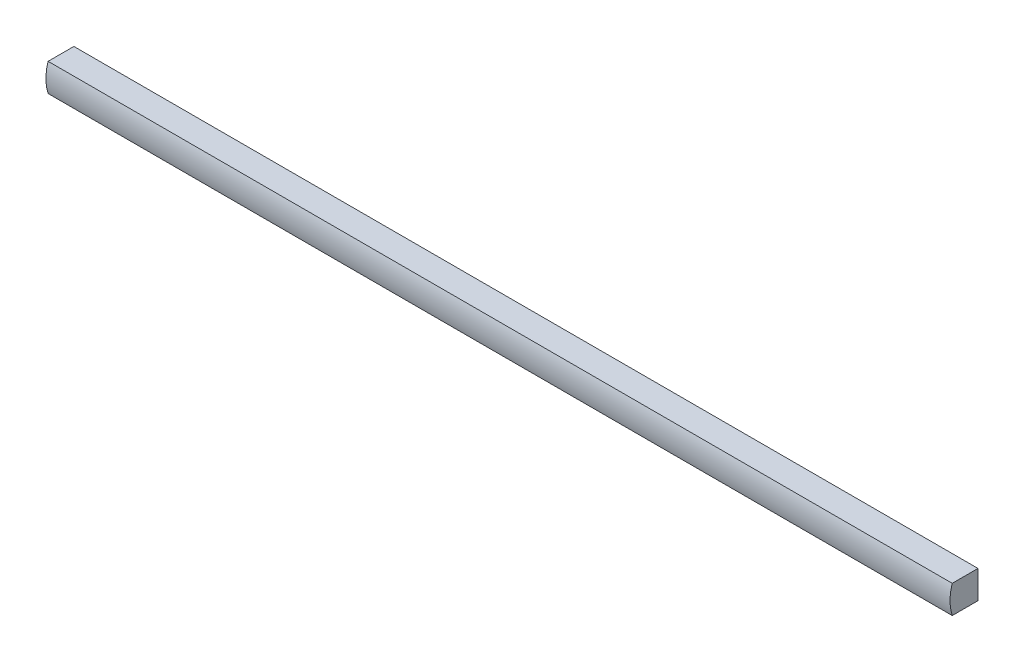
ISO-10303-21;
HEADER;
FILE_DESCRIPTION(('STEP AP214'),'2;1');
FILE_NAME('part.step','',(''),(''),'','','');
FILE_SCHEMA(('AUTOMOTIVE_DESIGN { 1 0 10303 214 1 1 1 1 }'));
ENDSEC;
DATA;
#1=APPLICATION_CONTEXT('core data for automotive mechanical design processes');
#2=APPLICATION_PROTOCOL_DEFINITION('international standard','automotive_design',2000,#1);
#3=PRODUCT_CONTEXT('',#1,'mechanical');
#4=PRODUCT('Part','Part','',(#3));
#5=PRODUCT_RELATED_PRODUCT_CATEGORY('part','',(#4));
#6=PRODUCT_DEFINITION_FORMATION('','',#4);
#7=PRODUCT_DEFINITION_CONTEXT('part definition',#1,'design');
#8=PRODUCT_DEFINITION('design','',#6,#7);
#9=PRODUCT_DEFINITION_SHAPE('','',#8);
#10=(LENGTH_UNIT() NAMED_UNIT(*) SI_UNIT(.MILLI.,.METRE.));
#11=(NAMED_UNIT(*) PLANE_ANGLE_UNIT() SI_UNIT($,.RADIAN.));
#12=(NAMED_UNIT(*) SI_UNIT($,.STERADIAN.) SOLID_ANGLE_UNIT());
#13=UNCERTAINTY_MEASURE_WITH_UNIT(LENGTH_MEASURE(1.E-05),#10,'distance_accuracy_value','');
#14=(GEOMETRIC_REPRESENTATION_CONTEXT(3) GLOBAL_UNCERTAINTY_ASSIGNED_CONTEXT((#13)) GLOBAL_UNIT_ASSIGNED_CONTEXT((#10,
#11,#12)) REPRESENTATION_CONTEXT('',''));
#15=CARTESIAN_POINT('',(0.,0.,0.));
#16=DIRECTION('',(0.,0.,1.));
#17=DIRECTION('',(1.,0.,0.));
#18=AXIS2_PLACEMENT_3D('',#15,#16,#17);
#19=CARTESIAN_POINT('',(-307.975,4.78267749181438,-15.5137071280691));
#20=DIRECTION('',(1.,0.,0.));
#21=DIRECTION('',(0.,0.,-1.));
#22=AXIS2_PLACEMENT_3D('',#19,#20,#21);
#23=CYLINDRICAL_SURFACE('',#22,15.5137071280691);
#24=CARTESIAN_POINT('',(0.,4.78267749181438,-15.5137071280691));
#25=DIRECTION('',(1.,0.,0.));
#26=DIRECTION('',(0.,0.,-1.));
#27=AXIS2_PLACEMENT_3D('',#24,#25,#26);
#28=CIRCLE('',#27,15.5137071280691);
#29=CARTESIAN_POINT('',(0.,0.,-0.755621044000001));
#30=VERTEX_POINT('',#29);
#31=CARTESIAN_POINT('',(0.,9.525,-0.742604052000002));
#32=VERTEX_POINT('',#31);
#33=EDGE_CURVE('E111',#30,#32,#28,.F.);
#34=ORIENTED_EDGE('',*,*,#33,.T.);
#35=DIRECTION('',(1.,0.,0.));
#36=VECTOR('',#35,1.);
#37=CARTESIAN_POINT('',(-307.975,9.525,-0.742604052000002));
#38=LINE('',#37,#36);
#39=CARTESIAN_POINT('',(-307.975,9.525,-0.742604052000002));
#40=VERTEX_POINT('',#39);
#41=EDGE_CURVE('E11',#40,#32,#38,.T.);
#42=ORIENTED_EDGE('',*,*,#41,.F.);
#43=CARTESIAN_POINT('',(-307.975,4.78267749181438,-15.5137071280691));
#44=DIRECTION('',(1.,0.,0.));
#45=DIRECTION('',(0.,0.,-1.));
#46=AXIS2_PLACEMENT_3D('',#43,#44,#45);
#47=CIRCLE('',#46,15.5137071280691);
#48=CARTESIAN_POINT('',(-307.975,0.,-0.755621044000001));
#49=VERTEX_POINT('',#48);
#50=EDGE_CURVE('E106',#49,#40,#47,.F.);
#51=ORIENTED_EDGE('',*,*,#50,.F.);
#52=DIRECTION('',(1.,0.,0.));
#53=VECTOR('',#52,1.);
#54=CARTESIAN_POINT('',(-307.975,0.,-0.755621044000001));
#55=LINE('',#54,#53);
#56=EDGE_CURVE('E50',#49,#30,#55,.T.);
#57=ORIENTED_EDGE('',*,*,#56,.T.);
#58=EDGE_LOOP('',(#34,#42,#51,#57));
#59=FACE_BOUND('',#58,.T.);
#60=ADVANCED_FACE('F47',(#59),#23,.T.);
#61=CARTESIAN_POINT('',(-307.975,9.525,0.));
#62=DIRECTION('',(0.,-1.,0.));
#63=DIRECTION('',(0.,0.,-1.));
#64=AXIS2_PLACEMENT_3D('',#61,#62,#63);
#65=PLANE('',#64);
#66=DIRECTION('',(0.,0.,-1.));
#67=VECTOR('',#66,1.);
#68=CARTESIAN_POINT('',(0.,9.525,0.));
#69=LINE('',#68,#67);
#70=CARTESIAN_POINT('',(0.,9.525,-9.525));
#71=VERTEX_POINT('',#70);
#72=EDGE_CURVE('E86',#32,#71,#69,.T.);
#73=ORIENTED_EDGE('',*,*,#72,.T.);
#74=DIRECTION('',(1.,0.,0.));
#75=VECTOR('',#74,1.);
#76=CARTESIAN_POINT('',(-307.975,9.525,-9.525));
#77=LINE('',#76,#75);
#78=CARTESIAN_POINT('',(-307.975,9.525,-9.525));
#79=VERTEX_POINT('',#78);
#80=EDGE_CURVE('E56',#79,#71,#77,.T.);
#81=ORIENTED_EDGE('',*,*,#80,.F.);
#82=DIRECTION('',(0.,0.,-1.));
#83=VECTOR('',#82,1.);
#84=CARTESIAN_POINT('',(-307.975,9.525,0.));
#85=LINE('',#84,#83);
#86=EDGE_CURVE('E64',#40,#79,#85,.T.);
#87=ORIENTED_EDGE('',*,*,#86,.F.);
#88=ORIENTED_EDGE('',*,*,#41,.T.);
#89=EDGE_LOOP('',(#73,#81,#87,#88));
#90=FACE_BOUND('',#89,.T.);
#91=ADVANCED_FACE('F118',(#90),#65,.F.);
#92=CARTESIAN_POINT('',(-307.975,0.,-9.525));
#93=DIRECTION('',(0.,0.,-1.));
#94=DIRECTION('',(-1.,0.,0.));
#95=AXIS2_PLACEMENT_3D('',#92,#93,#94);
#96=PLANE('',#95);
#97=DIRECTION('',(0.,1.,0.));
#98=VECTOR('',#97,1.);
#99=CARTESIAN_POINT('',(0.,0.,-9.525));
#100=LINE('',#99,#98);
#101=CARTESIAN_POINT('',(0.,0.,-9.525));
#102=VERTEX_POINT('',#101);
#103=EDGE_CURVE('E98',#102,#71,#100,.T.);
#104=ORIENTED_EDGE('',*,*,#103,.F.);
#105=DIRECTION('',(1.,0.,0.));
#106=VECTOR('',#105,1.);
#107=CARTESIAN_POINT('',(-307.975,0.,-9.525));
#108=LINE('',#107,#106);
#109=CARTESIAN_POINT('',(-307.975,0.,-9.525));
#110=VERTEX_POINT('',#109);
#111=EDGE_CURVE('E94',#110,#102,#108,.T.);
#112=ORIENTED_EDGE('',*,*,#111,.F.);
#113=DIRECTION('',(0.,1.,0.));
#114=VECTOR('',#113,1.);
#115=CARTESIAN_POINT('',(-307.975,0.,-9.525));
#116=LINE('',#115,#114);
#117=EDGE_CURVE('E97',#110,#79,#116,.T.);
#118=ORIENTED_EDGE('',*,*,#117,.T.);
#119=ORIENTED_EDGE('',*,*,#80,.T.);
#120=EDGE_LOOP('',(#104,#112,#118,#119));
#121=FACE_BOUND('',#120,.T.);
#122=ADVANCED_FACE('F96',(#121),#96,.T.);
#123=CARTESIAN_POINT('',(-307.975,0.,0.));
#124=DIRECTION('',(0.,-1.,0.));
#125=DIRECTION('',(0.,0.,-1.));
#126=AXIS2_PLACEMENT_3D('',#123,#124,#125);
#127=PLANE('',#126);
#128=DIRECTION('',(0.,0.,-1.));
#129=VECTOR('',#128,1.);
#130=CARTESIAN_POINT('',(0.,0.,0.));
#131=LINE('',#130,#129);
#132=EDGE_CURVE('E114',#30,#102,#131,.T.);
#133=ORIENTED_EDGE('',*,*,#132,.F.);
#134=ORIENTED_EDGE('',*,*,#56,.F.);
#135=DIRECTION('',(0.,0.,-1.));
#136=VECTOR('',#135,1.);
#137=CARTESIAN_POINT('',(-307.975,0.,0.));
#138=LINE('',#137,#136);
#139=EDGE_CURVE('E103',#49,#110,#138,.T.);
#140=ORIENTED_EDGE('',*,*,#139,.T.);
#141=ORIENTED_EDGE('',*,*,#111,.T.);
#142=EDGE_LOOP('',(#133,#134,#140,#141));
#143=FACE_BOUND('',#142,.T.);
#144=ADVANCED_FACE('F105',(#143),#127,.T.);
#145=CARTESIAN_POINT('',(-307.975,0.,0.));
#146=DIRECTION('',(1.,0.,0.));
#147=DIRECTION('',(0.,0.,-1.));
#148=AXIS2_PLACEMENT_3D('',#145,#146,#147);
#149=PLANE('',#148);
#150=ORIENTED_EDGE('',*,*,#50,.T.);
#151=ORIENTED_EDGE('',*,*,#86,.T.);
#152=ORIENTED_EDGE('',*,*,#117,.F.);
#153=ORIENTED_EDGE('',*,*,#139,.F.);
#154=EDGE_LOOP('',(#150,#151,#152,#153));
#155=FACE_BOUND('',#154,.T.);
#156=ADVANCED_FACE('F102',(#155),#149,.F.);
#157=CARTESIAN_POINT('',(0.,0.,0.));
#158=DIRECTION('',(1.,0.,0.));
#159=DIRECTION('',(0.,0.,-1.));
#160=AXIS2_PLACEMENT_3D('',#157,#158,#159);
#161=PLANE('',#160);
#162=ORIENTED_EDGE('',*,*,#33,.F.);
#163=ORIENTED_EDGE('',*,*,#132,.T.);
#164=ORIENTED_EDGE('',*,*,#103,.T.);
#165=ORIENTED_EDGE('',*,*,#72,.F.);
#166=EDGE_LOOP('',(#162,#163,#164,#165));
#167=FACE_BOUND('',#166,.T.);
#168=ADVANCED_FACE('F120',(#167),#161,.T.);
#169=CLOSED_SHELL('',(#60,#91,#122,#144,#156,#168));
#170=MANIFOLD_SOLID_BREP('B2',#169);
#171=ADVANCED_BREP_SHAPE_REPRESENTATION('',(#18,#170),#14);
#172=SHAPE_DEFINITION_REPRESENTATION(#9,#171);
ENDSEC;
END-ISO-10303-21;
